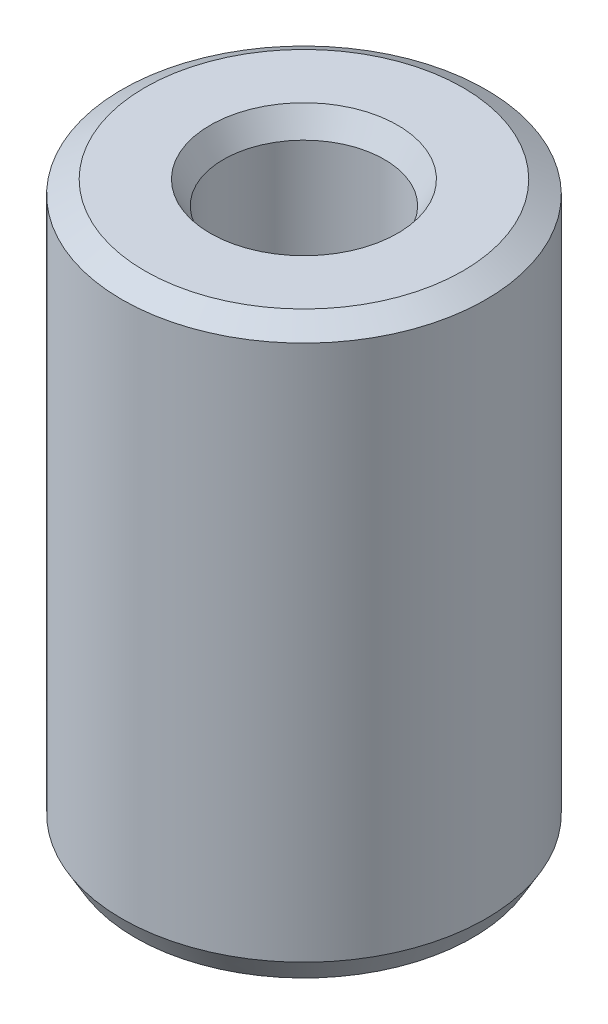
ISO-10303-21;
HEADER;
FILE_DESCRIPTION(('STEP AP214'),'2;1');
FILE_NAME('part.step','',(''),(''),'','','');
FILE_SCHEMA(('AUTOMOTIVE_DESIGN { 1 0 10303 214 1 1 1 1 }'));
ENDSEC;
DATA;
#1=APPLICATION_CONTEXT('core data for automotive mechanical design processes');
#2=APPLICATION_PROTOCOL_DEFINITION('international standard','automotive_design',2000,#1);
#3=PRODUCT_CONTEXT('',#1,'mechanical');
#4=PRODUCT('Part','Part','',(#3));
#5=PRODUCT_RELATED_PRODUCT_CATEGORY('part','',(#4));
#6=PRODUCT_DEFINITION_FORMATION('','',#4);
#7=PRODUCT_DEFINITION_CONTEXT('part definition',#1,'design');
#8=PRODUCT_DEFINITION('design','',#6,#7);
#9=PRODUCT_DEFINITION_SHAPE('','',#8);
#10=(LENGTH_UNIT() NAMED_UNIT(*) SI_UNIT(.MILLI.,.METRE.));
#11=(NAMED_UNIT(*) PLANE_ANGLE_UNIT() SI_UNIT($,.RADIAN.));
#12=(NAMED_UNIT(*) SI_UNIT($,.STERADIAN.) SOLID_ANGLE_UNIT());
#13=UNCERTAINTY_MEASURE_WITH_UNIT(LENGTH_MEASURE(1.E-05),#10,'distance_accuracy_value','');
#14=(GEOMETRIC_REPRESENTATION_CONTEXT(3) GLOBAL_UNCERTAINTY_ASSIGNED_CONTEXT((#13)) GLOBAL_UNIT_ASSIGNED_CONTEXT((#10,
#11,#12)) REPRESENTATION_CONTEXT('',''));
#15=CARTESIAN_POINT('',(0.,0.,0.));
#16=DIRECTION('',(0.,0.,1.));
#17=DIRECTION('',(1.,0.,0.));
#18=AXIS2_PLACEMENT_3D('',#15,#16,#17);
#19=CARTESIAN_POINT('',(0.,149.433588219899,0.));
#20=DIRECTION('',(0.,-1.,0.));
#21=DIRECTION('',(0.,0.,-1.));
#22=AXIS2_PLACEMENT_3D('',#19,#20,#21);
#23=CYLINDRICAL_SURFACE('',#22,47.5);
#24=CARTESIAN_POINT('',(0.,6.00696541117221,0.));
#25=DIRECTION('',(0.,1.,0.));
#26=DIRECTION('',(0.,0.,1.));
#27=AXIS2_PLACEMENT_3D('',#24,#25,#26);
#28=CIRCLE('',#27,47.5);
#29=CARTESIAN_POINT('',(0.,6.00696541117221,47.5));
#30=VERTEX_POINT('',#29);
#31=EDGE_CURVE('E10',#30,#30,#28,.T.);
#32=ORIENTED_EDGE('',*,*,#31,.T.);
#33=EDGE_LOOP('',(#32));
#34=FACE_BOUND('',#33,.T.);
#35=CARTESIAN_POINT('',(0.,145.965465122746,0.));
#36=DIRECTION('',(0.,1.,0.));
#37=DIRECTION('',(0.,0.,1.));
#38=AXIS2_PLACEMENT_3D('',#35,#36,#37);
#39=CIRCLE('',#38,47.5);
#40=CARTESIAN_POINT('',(0.,145.965465122746,47.5));
#41=VERTEX_POINT('',#40);
#42=EDGE_CURVE('E50',#41,#41,#39,.F.);
#43=ORIENTED_EDGE('',*,*,#42,.T.);
#44=EDGE_LOOP('',(#43));
#45=FACE_BOUND('',#44,.T.);
#46=ADVANCED_FACE('F39',(#34,#45),#23,.T.);
#47=CARTESIAN_POINT('',(0.,149.433588219899,0.));
#48=DIRECTION('',(0.,1.,0.));
#49=DIRECTION('',(0.,0.,1.));
#50=AXIS2_PLACEMENT_3D('',#47,#48,#49);
#51=PLANE('',#50);
#52=CARTESIAN_POINT('',(0.,149.433588219899,0.));
#53=DIRECTION('',(0.,1.,0.));
#54=DIRECTION('',(0.,0.,1.));
#55=AXIS2_PLACEMENT_3D('',#52,#53,#54);
#56=CIRCLE('',#55,24.4620653572805);
#57=CARTESIAN_POINT('',(0.,149.433588219899,24.4620653572805));
#58=VERTEX_POINT('',#57);
#59=EDGE_CURVE('E58',#58,#58,#56,.F.);
#60=ORIENTED_EDGE('',*,*,#59,.T.);
#61=EDGE_LOOP('',(#60));
#62=FACE_BOUND('',#61,.T.);
#63=CARTESIAN_POINT('',(0.,149.433588219899,0.));
#64=DIRECTION('',(0.,1.,0.));
#65=DIRECTION('',(0.,0.,1.));
#66=AXIS2_PLACEMENT_3D('',#63,#64,#65);
#67=CIRCLE('',#66,41.4930345888278);
#68=CARTESIAN_POINT('',(0.,149.433588219899,41.4930345888278));
#69=VERTEX_POINT('',#68);
#70=EDGE_CURVE('E61',#69,#69,#67,.T.);
#71=ORIENTED_EDGE('',*,*,#70,.T.);
#72=EDGE_LOOP('',(#71));
#73=FACE_BOUND('',#72,.T.);
#74=ADVANCED_FACE('F88',(#62,#73),#51,.T.);
#75=CARTESIAN_POINT('',(0.,0.,0.));
#76=DIRECTION('',(0.,1.,0.));
#77=DIRECTION('',(0.,0.,1.));
#78=AXIS2_PLACEMENT_3D('',#75,#76,#77);
#79=PLANE('',#78);
#80=CARTESIAN_POINT('',(0.,0.,0.));
#81=DIRECTION('',(0.,1.,0.));
#82=DIRECTION('',(0.,0.,1.));
#83=AXIS2_PLACEMENT_3D('',#80,#81,#82);
#84=CIRCLE('',#83,27.0009076712996);
#85=CARTESIAN_POINT('',(0.,0.,27.0009076712996));
#86=VERTEX_POINT('',#85);
#87=EDGE_CURVE('E51',#86,#86,#84,.T.);
#88=ORIENTED_EDGE('',*,*,#87,.T.);
#89=EDGE_LOOP('',(#88));
#90=FACE_BOUND('',#89,.T.);
#91=CARTESIAN_POINT('',(0.,0.,0.));
#92=DIRECTION('',(0.,1.,0.));
#93=DIRECTION('',(0.,0.,1.));
#94=AXIS2_PLACEMENT_3D('',#91,#92,#93);
#95=CIRCLE('',#94,44.0318769028469);
#96=CARTESIAN_POINT('',(0.,0.,44.0318769028469));
#97=VERTEX_POINT('',#96);
#98=EDGE_CURVE('E54',#97,#97,#95,.F.);
#99=ORIENTED_EDGE('',*,*,#98,.T.);
#100=EDGE_LOOP('',(#99));
#101=FACE_BOUND('',#100,.T.);
#102=ADVANCED_FACE('F83',(#90,#101),#79,.F.);
#103=CARTESIAN_POINT('',(0.,149.433588219899,0.));
#104=DIRECTION('',(0.,-1.,0.));
#105=DIRECTION('',(0.,0.,-1.));
#106=AXIS2_PLACEMENT_3D('',#103,#104,#105);
#107=CYLINDRICAL_SURFACE('',#106,20.9939422601274);
#108=CARTESIAN_POINT('',(0.,143.426622808727,0.));
#109=DIRECTION('',(0.,1.,0.));
#110=DIRECTION('',(0.,0.,1.));
#111=AXIS2_PLACEMENT_3D('',#108,#109,#110);
#112=CIRCLE('',#111,20.9939422601274);
#113=CARTESIAN_POINT('',(0.,143.426622808727,20.9939422601274));
#114=VERTEX_POINT('',#113);
#115=EDGE_CURVE('E67',#114,#114,#112,.T.);
#116=ORIENTED_EDGE('',*,*,#115,.T.);
#117=EDGE_LOOP('',(#116));
#118=FACE_BOUND('',#117,.T.);
#119=CARTESIAN_POINT('',(0.,3.46812309715305,0.));
#120=DIRECTION('',(0.,1.,0.));
#121=DIRECTION('',(0.,0.,1.));
#122=AXIS2_PLACEMENT_3D('',#119,#120,#121);
#123=CIRCLE('',#122,20.9939422601274);
#124=CARTESIAN_POINT('',(0.,3.46812309715305,20.9939422601274));
#125=VERTEX_POINT('',#124);
#126=EDGE_CURVE('E69',#125,#125,#123,.F.);
#127=ORIENTED_EDGE('',*,*,#126,.T.);
#128=EDGE_LOOP('',(#127));
#129=FACE_BOUND('',#128,.T.);
#130=ADVANCED_FACE('F71',(#118,#129),#107,.F.);
#131=CARTESIAN_POINT('',(0.,143.426622808727,0.));
#132=DIRECTION('',(0.,1.,0.));
#133=DIRECTION('',(0.,0.,1.));
#134=AXIS2_PLACEMENT_3D('',#131,#132,#133);
#135=CONICAL_SURFACE('',#134,20.9939422601274,0.523598775598299);
#136=ORIENTED_EDGE('',*,*,#59,.F.);
#137=EDGE_LOOP('',(#136));
#138=FACE_BOUND('',#137,.T.);
#139=ORIENTED_EDGE('',*,*,#115,.F.);
#140=EDGE_LOOP('',(#139));
#141=FACE_BOUND('',#140,.T.);
#142=ADVANCED_FACE('F77',(#138,#141),#135,.F.);
#143=CARTESIAN_POINT('',(0.,0.,0.));
#144=DIRECTION('',(0.,-1.,0.));
#145=DIRECTION('',(0.,0.,-1.));
#146=AXIS2_PLACEMENT_3D('',#143,#144,#145);
#147=CONICAL_SURFACE('',#146,27.0009076712996,1.04719755119659);
#148=ORIENTED_EDGE('',*,*,#126,.F.);
#149=EDGE_LOOP('',(#148));
#150=FACE_BOUND('',#149,.T.);
#151=ORIENTED_EDGE('',*,*,#87,.F.);
#152=EDGE_LOOP('',(#151));
#153=FACE_BOUND('',#152,.T.);
#154=ADVANCED_FACE('F73',(#150,#153),#147,.F.);
#155=CARTESIAN_POINT('',(0.,6.00696541117221,0.));
#156=DIRECTION('',(0.,1.,0.));
#157=DIRECTION('',(0.,0.,1.));
#158=AXIS2_PLACEMENT_3D('',#155,#156,#157);
#159=CONICAL_SURFACE('',#158,47.5,0.523598775598304);
#160=ORIENTED_EDGE('',*,*,#98,.F.);
#161=EDGE_LOOP('',(#160));
#162=FACE_BOUND('',#161,.T.);
#163=ORIENTED_EDGE('',*,*,#31,.F.);
#164=EDGE_LOOP('',(#163));
#165=FACE_BOUND('',#164,.T.);
#166=ADVANCED_FACE('F76',(#162,#165),#159,.T.);
#167=CARTESIAN_POINT('',(0.,149.433588219899,0.));
#168=DIRECTION('',(0.,-1.,0.));
#169=DIRECTION('',(0.,0.,-1.));
#170=AXIS2_PLACEMENT_3D('',#167,#168,#169);
#171=CONICAL_SURFACE('',#170,41.4930345888278,1.04719755119659);
#172=ORIENTED_EDGE('',*,*,#42,.F.);
#173=EDGE_LOOP('',(#172));
#174=FACE_BOUND('',#173,.T.);
#175=ORIENTED_EDGE('',*,*,#70,.F.);
#176=EDGE_LOOP('',(#175));
#177=FACE_BOUND('',#176,.T.);
#178=ADVANCED_FACE('F45',(#174,#177),#171,.T.);
#179=CLOSED_SHELL('',(#46,#74,#102,#130,#142,#154,#166,#178));
#180=MANIFOLD_SOLID_BREP('B2',#179);
#181=ADVANCED_BREP_SHAPE_REPRESENTATION('',(#18,#180),#14);
#182=SHAPE_DEFINITION_REPRESENTATION(#9,#181);
ENDSEC;
END-ISO-10303-21;
